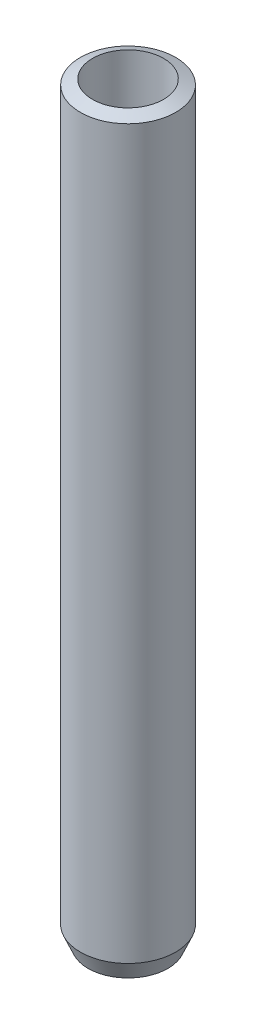
ISO-10303-21;
HEADER;
FILE_DESCRIPTION(('STEP AP214'),'2;1');
FILE_NAME('part.step','',(''),(''),'','','');
FILE_SCHEMA(('AUTOMOTIVE_DESIGN { 1 0 10303 214 1 1 1 1 }'));
ENDSEC;
DATA;
#1=APPLICATION_CONTEXT('core data for automotive mechanical design processes');
#2=APPLICATION_PROTOCOL_DEFINITION('international standard','automotive_design',2000,#1);
#3=PRODUCT_CONTEXT('',#1,'mechanical');
#4=PRODUCT('Part','Part','',(#3));
#5=PRODUCT_RELATED_PRODUCT_CATEGORY('part','',(#4));
#6=PRODUCT_DEFINITION_FORMATION('','',#4);
#7=PRODUCT_DEFINITION_CONTEXT('part definition',#1,'design');
#8=PRODUCT_DEFINITION('design','',#6,#7);
#9=PRODUCT_DEFINITION_SHAPE('','',#8);
#10=(LENGTH_UNIT() NAMED_UNIT(*) SI_UNIT(.MILLI.,.METRE.));
#11=(NAMED_UNIT(*) PLANE_ANGLE_UNIT() SI_UNIT($,.RADIAN.));
#12=(NAMED_UNIT(*) SI_UNIT($,.STERADIAN.) SOLID_ANGLE_UNIT());
#13=UNCERTAINTY_MEASURE_WITH_UNIT(LENGTH_MEASURE(1.E-05),#10,'distance_accuracy_value','');
#14=(GEOMETRIC_REPRESENTATION_CONTEXT(3) GLOBAL_UNCERTAINTY_ASSIGNED_CONTEXT((#13)) GLOBAL_UNIT_ASSIGNED_CONTEXT((#10,
#11,#12)) REPRESENTATION_CONTEXT('',''));
#15=CARTESIAN_POINT('',(0.,0.,0.));
#16=DIRECTION('',(0.,0.,1.));
#17=DIRECTION('',(1.,0.,0.));
#18=AXIS2_PLACEMENT_3D('',#15,#16,#17);
#19=CARTESIAN_POINT('',(0.,473.873449766459,0.));
#20=DIRECTION('',(0.,-1.,0.));
#21=DIRECTION('',(0.,0.,-1.));
#22=AXIS2_PLACEMENT_3D('',#19,#20,#21);
#23=CYLINDRICAL_SURFACE('',#22,30.);
#24=CARTESIAN_POINT('',(0.,468.999568440286,0.));
#25=DIRECTION('',(0.,1.,0.));
#26=DIRECTION('',(0.,0.,1.));
#27=AXIS2_PLACEMENT_3D('',#24,#25,#26);
#28=CIRCLE('',#27,30.);
#29=CARTESIAN_POINT('',(0.,468.999568440286,-30.));
#30=VERTEX_POINT('',#29);
#31=EDGE_CURVE('E50',#30,#30,#28,.F.);
#32=CARTESIAN_POINT('',(0.,11.357930299183,0.));
#33=DIRECTION('',(0.,1.,0.));
#34=DIRECTION('',(0.,0.,1.));
#35=AXIS2_PLACEMENT_3D('',#32,#33,#34);
#36=CIRCLE('',#35,30.);
#37=CARTESIAN_POINT('',(0.,11.357930299183,-30.));
#38=VERTEX_POINT('',#37);
#39=EDGE_CURVE('E51',#38,#38,#36,.T.);
#40=CARTESIAN_POINT('',(0.,468.999568440286,-30.));
#41=CARTESIAN_POINT('',(0.,464.232468042983,-30.));
#42=CARTESIAN_POINT('',(0.,459.46536764568,-30.));
#43=CARTESIAN_POINT('',(0.,449.931166851074,-30.));
#44=CARTESIAN_POINT('',(0.,445.164066453771,-30.));
#45=CARTESIAN_POINT('',(0.,435.629865659164,-30.));
#46=CARTESIAN_POINT('',(0.,430.862765261861,-30.));
#47=CARTESIAN_POINT('',(0.,421.328564467255,-30.));
#48=CARTESIAN_POINT('',(0.,416.561464069952,-30.));
#49=CARTESIAN_POINT('',(0.,407.027263275345,-30.));
#50=CARTESIAN_POINT('',(0.,402.260162878042,-30.));
#51=CARTESIAN_POINT('',(0.,392.725962083436,-30.));
#52=CARTESIAN_POINT('',(0.,387.958861686133,-30.));
#53=CARTESIAN_POINT('',(0.,378.424660891526,-30.));
#54=CARTESIAN_POINT('',(0.,373.657560494223,-30.));
#55=CARTESIAN_POINT('',(0.,364.123359699617,-30.));
#56=CARTESIAN_POINT('',(0.,359.356259302314,-30.));
#57=CARTESIAN_POINT('',(0.,349.822058507707,-30.));
#58=CARTESIAN_POINT('',(0.,345.054958110404,-30.));
#59=CARTESIAN_POINT('',(0.,335.520757315798,-30.));
#60=CARTESIAN_POINT('',(0.,330.753656918495,-30.));
#61=CARTESIAN_POINT('',(0.,321.219456123888,-30.));
#62=CARTESIAN_POINT('',(0.,316.452355726585,-30.));
#63=CARTESIAN_POINT('',(0.,306.918154931979,-30.));
#64=CARTESIAN_POINT('',(0.,302.151054534676,-30.));
#65=CARTESIAN_POINT('',(0.,292.616853740069,-30.));
#66=CARTESIAN_POINT('',(0.,287.849753342766,-30.));
#67=CARTESIAN_POINT('',(0.,278.31555254816,-30.));
#68=CARTESIAN_POINT('',(0.,273.548452150857,-30.));
#69=CARTESIAN_POINT('',(0.,264.01425135625,-30.));
#70=CARTESIAN_POINT('',(0.,259.247150958947,-30.));
#71=CARTESIAN_POINT('',(0.,249.712950164341,-30.));
#72=CARTESIAN_POINT('',(0.,244.945849767038,-30.));
#73=CARTESIAN_POINT('',(0.,235.411648972431,-30.));
#74=CARTESIAN_POINT('',(0.,230.644548575128,-30.));
#75=CARTESIAN_POINT('',(0.,221.110347780522,-30.));
#76=CARTESIAN_POINT('',(0.,216.343247383219,-30.));
#77=CARTESIAN_POINT('',(0.,206.809046588613,-30.));
#78=CARTESIAN_POINT('',(0.,202.041946191309,-30.));
#79=CARTESIAN_POINT('',(0.,192.507745396703,-30.));
#80=CARTESIAN_POINT('',(0.,187.7406449994,-30.));
#81=CARTESIAN_POINT('',(0.,178.206444204794,-30.));
#82=CARTESIAN_POINT('',(0.,173.43934380749,-30.));
#83=CARTESIAN_POINT('',(0.,163.905143012884,-30.));
#84=CARTESIAN_POINT('',(0.,159.138042615581,-30.));
#85=CARTESIAN_POINT('',(0.,149.603841820975,-30.));
#86=CARTESIAN_POINT('',(0.,144.836741423671,-30.));
#87=CARTESIAN_POINT('',(0.,135.302540629065,-30.));
#88=CARTESIAN_POINT('',(0.,130.535440231762,-30.));
#89=CARTESIAN_POINT('',(0.,121.001239437156,-30.));
#90=CARTESIAN_POINT('',(0.,116.234139039852,-30.));
#91=CARTESIAN_POINT('',(0.,106.699938245246,-30.));
#92=CARTESIAN_POINT('',(0.,101.932837847943,-30.));
#93=CARTESIAN_POINT('',(0.,92.3986370533367,-30.));
#94=CARTESIAN_POINT('',(0.,87.6315366560335,-30.));
#95=CARTESIAN_POINT('',(0.,78.0973358614272,-30.));
#96=CARTESIAN_POINT('',(0.,73.330235464124,-30.));
#97=CARTESIAN_POINT('',(0.,63.7960346695177,-30.));
#98=CARTESIAN_POINT('',(0.,59.0289342722146,-30.));
#99=CARTESIAN_POINT('',(0.,49.4947334776082,-30.));
#100=CARTESIAN_POINT('',(0.,44.7276330803051,-30.));
#101=CARTESIAN_POINT('',(0.,35.1934322856988,-30.));
#102=CARTESIAN_POINT('',(0.,30.4263318883956,-30.));
#103=CARTESIAN_POINT('',(0.,20.8921310937893,-30.));
#104=CARTESIAN_POINT('',(0.,16.1250306964861,-30.));
#105=CARTESIAN_POINT('',(0.,11.357930299183,-30.));
#106=B_SPLINE_CURVE_WITH_KNOTS('',3,(#40,#41,#42,#43,#44,#45,#46,#47,#48,#49,#50,#51,#52,#53,
#54,#55,#56,#57,#58,#59,#60,#61,#62,#63,#64,#65,#66,#67,#68,#69,#70,#71,#72,#73,#74,#75,#76,#77,
#78,#79,#80,#81,#82,#83,#84,#85,#86,#87,#88,#89,#90,#91,#92,#93,#94,#95,#96,#97,#98,#99,#100,
#101,#102,#103,#104,#105),.UNSPECIFIED.,.F.,.F.,(4,2,2,2,2,2,2,2,2,2,2,2,2,2,2,2,2,2,2,2,2,2,2,
2,2,2,2,2,2,2,2,2,4),(0.,14.3013011919095,28.6026023838189,42.9039035757284,57.2052047676379,
71.5065059595474,85.8078071514569,100.109108343366,114.410409535276,128.711710727185,
143.013011919095,157.314313111004,171.615614302914,185.916915494823,200.218216686733,
214.519517878642,228.820819070552,243.122120262461,257.423421454371,271.72472264628,
286.02602383819,300.327325030099,314.628626222009,328.929927413918,343.231228605827,
357.532529797737,371.833830989646,386.135132181556,400.436433373465,414.737734565375,
429.039035757284,443.340336949194,457.641638141103),.UNSPECIFIED.);
#107=EDGE_CURVE('BSEAM39',#30,#38,#106,.T.);
#108=ORIENTED_EDGE('',*,*,#31,.T.);
#109=ORIENTED_EDGE('',*,*,#39,.T.);
#110=ORIENTED_EDGE('',*,*,#107,.T.);
#111=ORIENTED_EDGE('',*,*,#107,.F.);
#112=EDGE_LOOP('',(#108,#110,#109,#111));
#113=FACE_BOUND('',#112,.T.);
#114=ADVANCED_FACE('F39',(#113),#23,.T.);
#115=CARTESIAN_POINT('',(0.,0.,0.));
#116=DIRECTION('',(0.,1.,0.));
#117=DIRECTION('',(0.,0.,1.));
#118=AXIS2_PLACEMENT_3D('',#115,#116,#117);
#119=PLANE('',#118);
#120=CARTESIAN_POINT('',(0.,0.,0.));
#121=DIRECTION('',(0.,1.,0.));
#122=DIRECTION('',(0.,0.,1.));
#123=AXIS2_PLACEMENT_3D('',#120,#121,#122);
#124=CIRCLE('',#123,25.1261186738263);
#125=CARTESIAN_POINT('',(0.,0.,25.1261186738263));
#126=VERTEX_POINT('',#125);
#127=EDGE_CURVE('E10',#126,#126,#124,.F.);
#128=ORIENTED_EDGE('',*,*,#127,.T.);
#129=EDGE_LOOP('',(#128));
#130=FACE_BOUND('',#129,.T.);
#131=CARTESIAN_POINT('',(0.,0.,0.));
#132=DIRECTION('',(0.,1.,0.));
#133=DIRECTION('',(0.,0.,1.));
#134=AXIS2_PLACEMENT_3D('',#131,#132,#133);
#135=CIRCLE('',#134,22.3832139746597);
#136=CARTESIAN_POINT('',(0.,0.,-22.3832139746597));
#137=VERTEX_POINT('',#136);
#138=EDGE_CURVE('E58',#137,#137,#135,.T.);
#139=ORIENTED_EDGE('',*,*,#138,.T.);
#140=EDGE_LOOP('',(#139));
#141=FACE_BOUND('',#140,.T.);
#142=ADVANCED_FACE('F62',(#130,#141),#119,.F.);
#143=CARTESIAN_POINT('',(0.,473.873449766459,0.));
#144=DIRECTION('',(0.,-1.,0.));
#145=DIRECTION('',(0.,0.,-1.));
#146=AXIS2_PLACEMENT_3D('',#143,#144,#145);
#147=CYLINDRICAL_SURFACE('',#146,22.3832139746597);
#148=CARTESIAN_POINT('',(0.,472.268061043823,0.));
#149=DIRECTION('',(0.,-1.,0.));
#150=DIRECTION('',(0.,0.,-1.));
#151=AXIS2_PLACEMENT_3D('',#148,#149,#150);
#152=CIRCLE('',#151,22.3832139746597);
#153=CARTESIAN_POINT('',(0.,472.268061043823,-22.3832139746597));
#154=VERTEX_POINT('',#153);
#155=EDGE_CURVE('E54',#154,#154,#152,.F.);
#156=CARTESIAN_POINT('',(0.,472.268061043823,-22.3832139746597));
#157=CARTESIAN_POINT('',(0.,467.348602074617,-22.3832139746597));
#158=CARTESIAN_POINT('',(0.,462.42914310541,-22.3832139746597));
#159=CARTESIAN_POINT('',(0.,452.590225166997,-22.3832139746597));
#160=CARTESIAN_POINT('',(0.,447.670766197791,-22.3832139746597));
#161=CARTESIAN_POINT('',(0.,437.831848259378,-22.3832139746597));
#162=CARTESIAN_POINT('',(0.,432.912389290171,-22.3832139746597));
#163=CARTESIAN_POINT('',(0.,423.073471351758,-22.3832139746597));
#164=CARTESIAN_POINT('',(0.,418.154012382552,-22.3832139746597));
#165=CARTESIAN_POINT('',(0.,408.315094444139,-22.3832139746597));
#166=CARTESIAN_POINT('',(0.,403.395635474932,-22.3832139746597));
#167=CARTESIAN_POINT('',(0.,393.556717536519,-22.3832139746597));
#168=CARTESIAN_POINT('',(0.,388.637258567313,-22.3832139746597));
#169=CARTESIAN_POINT('',(0.,378.7983406289,-22.3832139746597));
#170=CARTESIAN_POINT('',(0.,373.878881659693,-22.3832139746597));
#171=CARTESIAN_POINT('',(0.,364.03996372128,-22.3832139746597));
#172=CARTESIAN_POINT('',(0.,359.120504752074,-22.3832139746597));
#173=CARTESIAN_POINT('',(0.,349.281586813661,-22.3832139746597));
#174=CARTESIAN_POINT('',(0.,344.362127844454,-22.3832139746597));
#175=CARTESIAN_POINT('',(0.,334.523209906041,-22.3832139746597));
#176=CARTESIAN_POINT('',(0.,329.603750936835,-22.3832139746597));
#177=CARTESIAN_POINT('',(0.,319.764832998422,-22.3832139746597));
#178=CARTESIAN_POINT('',(0.,314.845374029215,-22.3832139746597));
#179=CARTESIAN_POINT('',(0.,305.006456090802,-22.3832139746597));
#180=CARTESIAN_POINT('',(0.,300.086997121596,-22.3832139746597));
#181=CARTESIAN_POINT('',(0.,290.248079183183,-22.3832139746597));
#182=CARTESIAN_POINT('',(0.,285.328620213976,-22.3832139746597));
#183=CARTESIAN_POINT('',(0.,275.489702275564,-22.3832139746597));
#184=CARTESIAN_POINT('',(0.,270.570243306357,-22.3832139746597));
#185=CARTESIAN_POINT('',(0.,260.731325367944,-22.3832139746597));
#186=CARTESIAN_POINT('',(0.,255.811866398737,-22.3832139746597));
#187=CARTESIAN_POINT('',(0.,245.972948460325,-22.3832139746597));
#188=CARTESIAN_POINT('',(0.,241.053489491118,-22.3832139746597));
#189=CARTESIAN_POINT('',(0.,231.214571552705,-22.3832139746597));
#190=CARTESIAN_POINT('',(0.,226.295112583499,-22.3832139746597));
#191=CARTESIAN_POINT('',(0.,216.456194645086,-22.3832139746597));
#192=CARTESIAN_POINT('',(0.,211.536735675879,-22.3832139746597));
#193=CARTESIAN_POINT('',(0.,201.697817737466,-22.3832139746597));
#194=CARTESIAN_POINT('',(0.,196.77835876826,-22.3832139746597));
#195=CARTESIAN_POINT('',(0.,186.939440829847,-22.3832139746597));
#196=CARTESIAN_POINT('',(0.,182.01998186064,-22.3832139746597));
#197=CARTESIAN_POINT('',(0.,172.181063922227,-22.3832139746597));
#198=CARTESIAN_POINT('',(0.,167.261604953021,-22.3832139746597));
#199=CARTESIAN_POINT('',(0.,157.422687014608,-22.3832139746597));
#200=CARTESIAN_POINT('',(0.,152.503228045401,-22.3832139746597));
#201=CARTESIAN_POINT('',(0.,142.664310106988,-22.3832139746597));
#202=CARTESIAN_POINT('',(0.,137.744851137782,-22.3832139746597));
#203=CARTESIAN_POINT('',(0.,127.905933199369,-22.3832139746597));
#204=CARTESIAN_POINT('',(0.,122.986474230162,-22.3832139746597));
#205=CARTESIAN_POINT('',(0.,113.147556291749,-22.3832139746597));
#206=CARTESIAN_POINT('',(0.,108.228097322543,-22.3832139746597));
#207=CARTESIAN_POINT('',(0.,98.3891793841298,-22.3832139746597));
#208=CARTESIAN_POINT('',(0.,93.4697204149233,-22.3832139746597));
#209=CARTESIAN_POINT('',(0.,83.6308024765104,-22.3832139746597));
#210=CARTESIAN_POINT('',(0.,78.7113435073039,-22.3832139746597));
#211=CARTESIAN_POINT('',(0.,68.8724255688909,-22.3832139746597));
#212=CARTESIAN_POINT('',(0.,63.9529665996844,-22.3832139746597));
#213=CARTESIAN_POINT('',(0.,54.1140486612714,-22.3832139746597));
#214=CARTESIAN_POINT('',(0.,49.1945896920649,-22.3832139746597));
#215=CARTESIAN_POINT('',(0.,39.3556717536519,-22.3832139746597));
#216=CARTESIAN_POINT('',(0.,34.4362127844454,-22.3832139746597));
#217=CARTESIAN_POINT('',(0.,24.5972948460324,-22.3832139746597));
#218=CARTESIAN_POINT('',(0.,19.677835876826,-22.3832139746597));
#219=CARTESIAN_POINT('',(0.,9.838917938413,-22.3832139746597));
#220=CARTESIAN_POINT('',(0.,4.91945896920649,-22.3832139746597));
#221=CARTESIAN_POINT('',(0.,0.,-22.3832139746597));
#222=B_SPLINE_CURVE_WITH_KNOTS('',3,(#156,#157,#158,#159,#160,#161,#162,#163,#164,#165,#166,
#167,#168,#169,#170,#171,#172,#173,#174,#175,#176,#177,#178,#179,#180,#181,#182,#183,#184,#185,
#186,#187,#188,#189,#190,#191,#192,#193,#194,#195,#196,#197,#198,#199,#200,#201,#202,#203,#204,
#205,#206,#207,#208,#209,#210,#211,#212,#213,#214,#215,#216,#217,#218,#219,#220,#221),
.UNSPECIFIED.,.F.,.F.,(4,2,2,2,2,2,2,2,2,2,2,2,2,2,2,2,2,2,2,2,2,2,2,2,2,2,2,2,2,2,2,2,4),(0.,
14.7583769076195,29.516753815239,44.2751307228584,59.0335076304779,73.7918845380974,
88.5502614457169,103.308638353336,118.067015260956,132.825392168575,147.583769076195,
162.342145983814,177.100522891434,191.858899799053,206.617276706673,221.375653614292,
236.134030521912,250.892407429531,265.650784337151,280.40916124477,295.167538152389,
309.925915060009,324.684291967628,339.442668875248,354.201045782867,368.959422690487,
383.717799598106,398.476176505726,413.234553413345,427.992930320965,442.751307228584,
457.509684136204,472.268061043823),.UNSPECIFIED.);
#223=EDGE_CURVE('BSEAM68',#154,#137,#222,.T.);
#224=ORIENTED_EDGE('',*,*,#155,.T.);
#225=ORIENTED_EDGE('',*,*,#138,.F.);
#226=ORIENTED_EDGE('',*,*,#223,.T.);
#227=ORIENTED_EDGE('',*,*,#223,.F.);
#228=EDGE_LOOP('',(#224,#226,#225,#227));
#229=FACE_BOUND('',#228,.T.);
#230=ADVANCED_FACE('F68',(#229),#147,.F.);
#231=CARTESIAN_POINT('',(0.,473.873449766459,0.));
#232=DIRECTION('',(0.,-1.,0.));
#233=DIRECTION('',(0.,0.,-1.));
#234=AXIS2_PLACEMENT_3D('',#231,#232,#233);
#235=CONICAL_SURFACE('',#234,18.6420697008182,1.16544369175579);
#236=ORIENTED_EDGE('',*,*,#31,.F.);
#237=EDGE_LOOP('',(#236));
#238=FACE_BOUND('',#237,.T.);
#239=ORIENTED_EDGE('',*,*,#155,.F.);
#240=EDGE_LOOP('',(#239));
#241=FACE_BOUND('',#240,.T.);
#242=ADVANCED_FACE('F66',(#238,#241),#235,.T.);
#243=CARTESIAN_POINT('',(0.,11.357930299183,0.));
#244=DIRECTION('',(0.,1.,0.));
#245=DIRECTION('',(0.,0.,1.));
#246=AXIS2_PLACEMENT_3D('',#243,#244,#245);
#247=CONICAL_SURFACE('',#246,30.,0.405352635039108);
#248=ORIENTED_EDGE('',*,*,#127,.F.);
#249=EDGE_LOOP('',(#248));
#250=FACE_BOUND('',#249,.T.);
#251=ORIENTED_EDGE('',*,*,#39,.F.);
#252=EDGE_LOOP('',(#251));
#253=FACE_BOUND('',#252,.T.);
#254=ADVANCED_FACE('F45',(#250,#253),#247,.T.);
#255=CLOSED_SHELL('',(#114,#142,#230,#242,#254));
#256=MANIFOLD_SOLID_BREP('B2',#255);
#257=ADVANCED_BREP_SHAPE_REPRESENTATION('',(#18,#256),#14);
#258=SHAPE_DEFINITION_REPRESENTATION(#9,#257);
ENDSEC;
END-ISO-10303-21;
